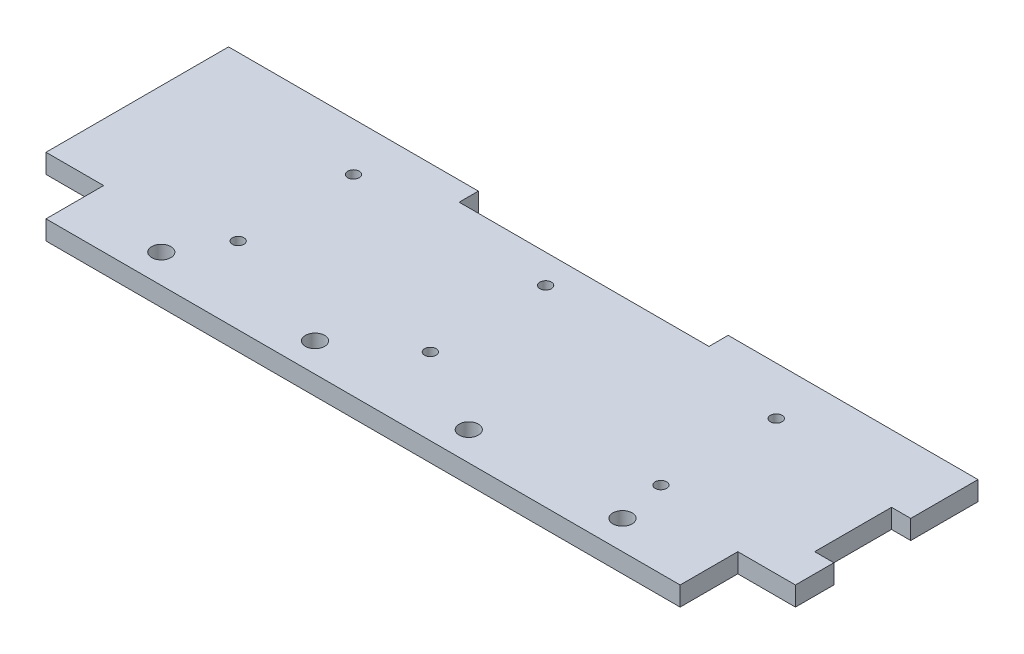
ISO-10303-21;
HEADER;
FILE_DESCRIPTION(('STEP AP214'),'2;1');
FILE_NAME('part.step','',(''),(''),'','','');
FILE_SCHEMA(('AUTOMOTIVE_DESIGN { 1 0 10303 214 1 1 1 1 }'));
ENDSEC;
DATA;
#1=APPLICATION_CONTEXT('core data for automotive mechanical design processes');
#2=APPLICATION_PROTOCOL_DEFINITION('international standard','automotive_design',2000,#1);
#3=PRODUCT_CONTEXT('',#1,'mechanical');
#4=PRODUCT('Part','Part','',(#3));
#5=PRODUCT_RELATED_PRODUCT_CATEGORY('part','',(#4));
#6=PRODUCT_DEFINITION_FORMATION('','',#4);
#7=PRODUCT_DEFINITION_CONTEXT('part definition',#1,'design');
#8=PRODUCT_DEFINITION('design','',#6,#7);
#9=PRODUCT_DEFINITION_SHAPE('','',#8);
#10=(LENGTH_UNIT() NAMED_UNIT(*) SI_UNIT(.MILLI.,.METRE.));
#11=(NAMED_UNIT(*) PLANE_ANGLE_UNIT() SI_UNIT($,.RADIAN.));
#12=(NAMED_UNIT(*) SI_UNIT($,.STERADIAN.) SOLID_ANGLE_UNIT());
#13=UNCERTAINTY_MEASURE_WITH_UNIT(LENGTH_MEASURE(1.E-05),#10,'distance_accuracy_value','');
#14=(GEOMETRIC_REPRESENTATION_CONTEXT(3) GLOBAL_UNCERTAINTY_ASSIGNED_CONTEXT((#13)) GLOBAL_UNIT_ASSIGNED_CONTEXT((#10,
#11,#12)) REPRESENTATION_CONTEXT('',''));
#15=CARTESIAN_POINT('',(0.,0.,0.));
#16=DIRECTION('',(0.,0.,1.));
#17=DIRECTION('',(1.,0.,0.));
#18=AXIS2_PLACEMENT_3D('',#15,#16,#17);
#19=CARTESIAN_POINT('',(0.,10.,0.));
#20=DIRECTION('',(0.,-1.,0.));
#21=DIRECTION('',(0.,0.,-1.));
#22=AXIS2_PLACEMENT_3D('',#19,#20,#21);
#23=PLANE('',#22);
#24=DIRECTION('',(0.,0.,-1.));
#25=VECTOR('',#24,1.);
#26=CARTESIAN_POINT('',(-30.,10.,-15.));
#27=LINE('',#26,#25);
#28=CARTESIAN_POINT('',(-30.,10.,-15.));
#29=VERTEX_POINT('',#28);
#30=CARTESIAN_POINT('',(-30.,10.,-45.));
#31=VERTEX_POINT('',#30);
#32=EDGE_CURVE('E51',#29,#31,#27,.T.);
#33=ORIENTED_EDGE('',*,*,#32,.T.);
#34=DIRECTION('',(1.,0.,0.));
#35=VECTOR('',#34,1.);
#36=CARTESIAN_POINT('',(0.,10.,-45.));
#37=LINE('',#36,#35);
#38=CARTESIAN_POINT('',(0.,10.,-45.));
#39=VERTEX_POINT('',#38);
#40=EDGE_CURVE('E158',#31,#39,#37,.T.);
#41=ORIENTED_EDGE('',*,*,#40,.T.);
#42=DIRECTION('',(0.,0.,-1.));
#43=VECTOR('',#42,1.);
#44=CARTESIAN_POINT('',(0.,10.,-65.));
#45=LINE('',#44,#43);
#46=CARTESIAN_POINT('',(0.,10.,-65.));
#47=VERTEX_POINT('',#46);
#48=EDGE_CURVE('E252',#39,#47,#45,.T.);
#49=ORIENTED_EDGE('',*,*,#48,.T.);
#50=DIRECTION('',(-1.,0.,0.));
#51=VECTOR('',#50,1.);
#52=CARTESIAN_POINT('',(-10.,10.,-65.));
#53=LINE('',#52,#51);
#54=CARTESIAN_POINT('',(-10.,10.,-65.));
#55=VERTEX_POINT('',#54);
#56=EDGE_CURVE('E254',#47,#55,#53,.T.);
#57=ORIENTED_EDGE('',*,*,#56,.T.);
#58=DIRECTION('',(0.,0.,-1.));
#59=VECTOR('',#58,1.);
#60=CARTESIAN_POINT('',(-10.,10.,-105.));
#61=LINE('',#60,#59);
#62=CARTESIAN_POINT('',(-10.,10.,-105.));
#63=VERTEX_POINT('',#62);
#64=EDGE_CURVE('E257',#55,#63,#61,.T.);
#65=ORIENTED_EDGE('',*,*,#64,.T.);
#66=DIRECTION('',(1.,0.,0.));
#67=VECTOR('',#66,1.);
#68=CARTESIAN_POINT('',(0.,10.,-105.));
#69=LINE('',#68,#67);
#70=CARTESIAN_POINT('',(0.,10.,-105.));
#71=VERTEX_POINT('',#70);
#72=EDGE_CURVE('E259',#63,#71,#69,.T.);
#73=ORIENTED_EDGE('',*,*,#72,.T.);
#74=DIRECTION('',(0.,0.,-1.));
#75=VECTOR('',#74,1.);
#76=CARTESIAN_POINT('',(0.,10.,-140.));
#77=LINE('',#76,#75);
#78=CARTESIAN_POINT('',(0.,10.,-140.));
#79=VERTEX_POINT('',#78);
#80=EDGE_CURVE('E261',#71,#79,#77,.T.);
#81=ORIENTED_EDGE('',*,*,#80,.T.);
#82=DIRECTION('',(-1.,0.,0.));
#83=VECTOR('',#82,1.);
#84=CARTESIAN_POINT('',(0.,10.,-140.));
#85=LINE('',#84,#83);
#86=CARTESIAN_POINT('',(-130.,10.,-140.));
#87=VERTEX_POINT('',#86);
#88=EDGE_CURVE('E263',#79,#87,#85,.T.);
#89=ORIENTED_EDGE('',*,*,#88,.T.);
#90=DIRECTION('',(0.,0.,1.));
#91=VECTOR('',#90,1.);
#92=CARTESIAN_POINT('',(-130.,10.,-140.));
#93=LINE('',#92,#91);
#94=CARTESIAN_POINT('',(-130.,10.,-130.));
#95=VERTEX_POINT('',#94);
#96=EDGE_CURVE('E265',#87,#95,#93,.T.);
#97=ORIENTED_EDGE('',*,*,#96,.T.);
#98=DIRECTION('',(-1.,0.,0.));
#99=VECTOR('',#98,1.);
#100=CARTESIAN_POINT('',(-130.,10.,-130.));
#101=LINE('',#100,#99);
#102=CARTESIAN_POINT('',(-260.,10.,-130.));
#103=VERTEX_POINT('',#102);
#104=EDGE_CURVE('E267',#95,#103,#101,.T.);
#105=ORIENTED_EDGE('',*,*,#104,.T.);
#106=DIRECTION('',(0.,0.,-1.));
#107=VECTOR('',#106,1.);
#108=CARTESIAN_POINT('',(-260.,10.,-130.));
#109=LINE('',#108,#107);
#110=CARTESIAN_POINT('',(-260.,10.,-140.));
#111=VERTEX_POINT('',#110);
#112=EDGE_CURVE('E269',#103,#111,#109,.T.);
#113=ORIENTED_EDGE('',*,*,#112,.T.);
#114=DIRECTION('',(-1.,0.,0.));
#115=VECTOR('',#114,1.);
#116=CARTESIAN_POINT('',(-260.,10.,-140.));
#117=LINE('',#116,#115);
#118=CARTESIAN_POINT('',(-390.,10.,-140.));
#119=VERTEX_POINT('',#118);
#120=EDGE_CURVE('E271',#111,#119,#117,.T.);
#121=ORIENTED_EDGE('',*,*,#120,.T.);
#122=DIRECTION('',(0.,0.,1.));
#123=VECTOR('',#122,1.);
#124=CARTESIAN_POINT('',(-390.,10.,-15.));
#125=LINE('',#124,#123);
#126=CARTESIAN_POINT('',(-390.,10.,-45.));
#127=VERTEX_POINT('',#126);
#128=EDGE_CURVE('E273',#119,#127,#125,.T.);
#129=ORIENTED_EDGE('',*,*,#128,.T.);
#130=DIRECTION('',(1.,0.,0.));
#131=VECTOR('',#130,1.);
#132=CARTESIAN_POINT('',(-390.,10.,-45.));
#133=LINE('',#132,#131);
#134=CARTESIAN_POINT('',(-360.,10.,-45.));
#135=VERTEX_POINT('',#134);
#136=EDGE_CURVE('E178',#127,#135,#133,.T.);
#137=ORIENTED_EDGE('',*,*,#136,.T.);
#138=DIRECTION('',(0.,0.,1.));
#139=VECTOR('',#138,1.);
#140=CARTESIAN_POINT('',(-360.,10.,-15.));
#141=LINE('',#140,#139);
#142=CARTESIAN_POINT('',(-360.,10.,-15.));
#143=VERTEX_POINT('',#142);
#144=EDGE_CURVE('E181',#135,#143,#141,.T.);
#145=ORIENTED_EDGE('',*,*,#144,.T.);
#146=DIRECTION('',(1.,0.,0.));
#147=VECTOR('',#146,1.);
#148=CARTESIAN_POINT('',(0.,10.,-15.));
#149=LINE('',#148,#147);
#150=EDGE_CURVE('E168',#143,#29,#149,.T.);
#151=ORIENTED_EDGE('',*,*,#150,.T.);
#152=EDGE_LOOP('',(#33,#41,#49,#57,#65,#73,#81,#89,#97,#105,#113,#121,#129,#137,#145,#151));
#153=FACE_BOUND('',#152,.T.);
#154=CARTESIAN_POINT('',(-315.,10.,-30.));
#155=DIRECTION('',(0.,1.,0.));
#156=DIRECTION('',(0.,0.,1.));
#157=AXIS2_PLACEMENT_3D('',#154,#155,#156);
#158=CIRCLE('',#157,4.99999999999999);
#159=CARTESIAN_POINT('',(-315.,10.,-25.));
#160=VERTEX_POINT('',#159);
#161=EDGE_CURVE('E246',#160,#160,#158,.T.);
#162=ORIENTED_EDGE('',*,*,#161,.F.);
#163=EDGE_LOOP('',(#162));
#164=FACE_BOUND('',#163,.T.);
#165=CARTESIAN_POINT('',(-155.,10.,-30.));
#166=DIRECTION('',(0.,1.,0.));
#167=DIRECTION('',(0.,0.,1.));
#168=AXIS2_PLACEMENT_3D('',#165,#166,#167);
#169=CIRCLE('',#168,5.00000000000002);
#170=CARTESIAN_POINT('',(-155.,10.,-25.));
#171=VERTEX_POINT('',#170);
#172=EDGE_CURVE('E240',#171,#171,#169,.T.);
#173=ORIENTED_EDGE('',*,*,#172,.F.);
#174=EDGE_LOOP('',(#173));
#175=FACE_BOUND('',#174,.T.);
#176=CARTESIAN_POINT('',(-75.,10.,-30.));
#177=DIRECTION('',(0.,1.,0.));
#178=DIRECTION('',(0.,0.,1.));
#179=AXIS2_PLACEMENT_3D('',#176,#177,#178);
#180=CIRCLE('',#179,5.00000000000001);
#181=CARTESIAN_POINT('',(-75.,10.,-25.));
#182=VERTEX_POINT('',#181);
#183=EDGE_CURVE('E234',#182,#182,#180,.T.);
#184=ORIENTED_EDGE('',*,*,#183,.F.);
#185=EDGE_LOOP('',(#184));
#186=FACE_BOUND('',#185,.T.);
#187=CARTESIAN_POINT('',(-200.,10.,-55.));
#188=DIRECTION('',(0.,1.,0.));
#189=DIRECTION('',(0.,0.,1.));
#190=AXIS2_PLACEMENT_3D('',#187,#188,#189);
#191=CIRCLE('',#190,2.99999999999999);
#192=CARTESIAN_POINT('',(-200.,10.,-52.));
#193=VERTEX_POINT('',#192);
#194=EDGE_CURVE('E228',#193,#193,#191,.T.);
#195=ORIENTED_EDGE('',*,*,#194,.F.);
#196=EDGE_LOOP('',(#195));
#197=FACE_BOUND('',#196,.T.);
#198=CARTESIAN_POINT('',(-300.,10.,-55.));
#199=DIRECTION('',(0.,1.,0.));
#200=DIRECTION('',(0.,0.,1.));
#201=AXIS2_PLACEMENT_3D('',#198,#199,#200);
#202=CIRCLE('',#201,2.99999999999999);
#203=CARTESIAN_POINT('',(-300.,10.,-52.));
#204=VERTEX_POINT('',#203);
#205=EDGE_CURVE('E222',#204,#204,#202,.T.);
#206=ORIENTED_EDGE('',*,*,#205,.F.);
#207=EDGE_LOOP('',(#206));
#208=FACE_BOUND('',#207,.T.);
#209=CARTESIAN_POINT('',(-300.,10.,-115.));
#210=DIRECTION('',(0.,1.,0.));
#211=DIRECTION('',(0.,0.,1.));
#212=AXIS2_PLACEMENT_3D('',#209,#210,#211);
#213=CIRCLE('',#212,2.99999999999999);
#214=CARTESIAN_POINT('',(-300.,10.,-112.));
#215=VERTEX_POINT('',#214);
#216=EDGE_CURVE('E216',#215,#215,#213,.T.);
#217=ORIENTED_EDGE('',*,*,#216,.F.);
#218=EDGE_LOOP('',(#217));
#219=FACE_BOUND('',#218,.T.);
#220=CARTESIAN_POINT('',(-235.,10.,-30.));
#221=DIRECTION('',(0.,1.,0.));
#222=DIRECTION('',(0.,0.,1.));
#223=AXIS2_PLACEMENT_3D('',#220,#221,#222);
#224=CIRCLE('',#223,5.00000000000002);
#225=CARTESIAN_POINT('',(-235.,10.,-25.));
#226=VERTEX_POINT('',#225);
#227=EDGE_CURVE('E210',#226,#226,#224,.T.);
#228=ORIENTED_EDGE('',*,*,#227,.F.);
#229=EDGE_LOOP('',(#228));
#230=FACE_BOUND('',#229,.T.);
#231=CARTESIAN_POINT('',(-200.,10.,-115.));
#232=DIRECTION('',(0.,1.,0.));
#233=DIRECTION('',(0.,0.,1.));
#234=AXIS2_PLACEMENT_3D('',#231,#232,#233);
#235=CIRCLE('',#234,2.99999999999999);
#236=CARTESIAN_POINT('',(-200.,10.,-112.));
#237=VERTEX_POINT('',#236);
#238=EDGE_CURVE('E204',#237,#237,#235,.T.);
#239=ORIENTED_EDGE('',*,*,#238,.F.);
#240=EDGE_LOOP('',(#239));
#241=FACE_BOUND('',#240,.T.);
#242=CARTESIAN_POINT('',(-80.,10.,-115.));
#243=DIRECTION('',(0.,1.,0.));
#244=DIRECTION('',(0.,0.,1.));
#245=AXIS2_PLACEMENT_3D('',#242,#243,#244);
#246=CIRCLE('',#245,3.00000000000001);
#247=CARTESIAN_POINT('',(-80.,10.,-112.));
#248=VERTEX_POINT('',#247);
#249=EDGE_CURVE('E198',#248,#248,#246,.T.);
#250=ORIENTED_EDGE('',*,*,#249,.F.);
#251=EDGE_LOOP('',(#250));
#252=FACE_BOUND('',#251,.T.);
#253=CARTESIAN_POINT('',(-80.,10.,-55.));
#254=DIRECTION('',(0.,1.,0.));
#255=DIRECTION('',(0.,0.,1.));
#256=AXIS2_PLACEMENT_3D('',#253,#254,#255);
#257=CIRCLE('',#256,3.00000000000001);
#258=CARTESIAN_POINT('',(-80.,10.,-52.));
#259=VERTEX_POINT('',#258);
#260=EDGE_CURVE('E192',#259,#259,#257,.T.);
#261=ORIENTED_EDGE('',*,*,#260,.F.);
#262=EDGE_LOOP('',(#261));
#263=FACE_BOUND('',#262,.T.);
#264=ADVANCED_FACE('F36',(#153,#164,#175,#186,#197,#208,#219,#230,#241,#252,#263),#23,.F.);
#265=CARTESIAN_POINT('',(0.,0.,0.));
#266=DIRECTION('',(0.,-1.,0.));
#267=DIRECTION('',(0.,0.,-1.));
#268=AXIS2_PLACEMENT_3D('',#265,#266,#267);
#269=PLANE('',#268);
#270=DIRECTION('',(1.,0.,0.));
#271=VECTOR('',#270,1.);
#272=CARTESIAN_POINT('',(0.,0.,-45.));
#273=LINE('',#272,#271);
#274=CARTESIAN_POINT('',(-30.,0.,-45.));
#275=VERTEX_POINT('',#274);
#276=CARTESIAN_POINT('',(0.,0.,-45.));
#277=VERTEX_POINT('',#276);
#278=EDGE_CURVE('E169',#275,#277,#273,.T.);
#279=ORIENTED_EDGE('',*,*,#278,.F.);
#280=DIRECTION('',(0.,0.,-1.));
#281=VECTOR('',#280,1.);
#282=CARTESIAN_POINT('',(-30.,0.,-15.));
#283=LINE('',#282,#281);
#284=CARTESIAN_POINT('',(-30.,0.,-15.));
#285=VERTEX_POINT('',#284);
#286=EDGE_CURVE('E151',#285,#275,#283,.T.);
#287=ORIENTED_EDGE('',*,*,#286,.F.);
#288=DIRECTION('',(1.,0.,0.));
#289=VECTOR('',#288,1.);
#290=CARTESIAN_POINT('',(0.,0.,-15.));
#291=LINE('',#290,#289);
#292=CARTESIAN_POINT('',(-360.,0.,-15.));
#293=VERTEX_POINT('',#292);
#294=EDGE_CURVE('E255',#293,#285,#291,.T.);
#295=ORIENTED_EDGE('',*,*,#294,.F.);
#296=DIRECTION('',(0.,0.,1.));
#297=VECTOR('',#296,1.);
#298=CARTESIAN_POINT('',(-360.,0.,-15.));
#299=LINE('',#298,#297);
#300=CARTESIAN_POINT('',(-360.,0.,-45.));
#301=VERTEX_POINT('',#300);
#302=EDGE_CURVE('E59',#301,#293,#299,.T.);
#303=ORIENTED_EDGE('',*,*,#302,.F.);
#304=DIRECTION('',(1.,0.,0.));
#305=VECTOR('',#304,1.);
#306=CARTESIAN_POINT('',(-390.,0.,-45.));
#307=LINE('',#306,#305);
#308=CARTESIAN_POINT('',(-390.,0.,-45.));
#309=VERTEX_POINT('',#308);
#310=EDGE_CURVE('E184',#309,#301,#307,.T.);
#311=ORIENTED_EDGE('',*,*,#310,.F.);
#312=DIRECTION('',(0.,0.,1.));
#313=VECTOR('',#312,1.);
#314=CARTESIAN_POINT('',(-390.,0.,-15.));
#315=LINE('',#314,#313);
#316=CARTESIAN_POINT('',(-390.,0.,-140.));
#317=VERTEX_POINT('',#316);
#318=EDGE_CURVE('E297',#317,#309,#315,.T.);
#319=ORIENTED_EDGE('',*,*,#318,.F.);
#320=DIRECTION('',(-1.,0.,0.));
#321=VECTOR('',#320,1.);
#322=CARTESIAN_POINT('',(-260.,0.,-140.));
#323=LINE('',#322,#321);
#324=CARTESIAN_POINT('',(-260.,0.,-140.));
#325=VERTEX_POINT('',#324);
#326=EDGE_CURVE('E295',#325,#317,#323,.T.);
#327=ORIENTED_EDGE('',*,*,#326,.F.);
#328=DIRECTION('',(0.,0.,-1.));
#329=VECTOR('',#328,1.);
#330=CARTESIAN_POINT('',(-260.,0.,-130.));
#331=LINE('',#330,#329);
#332=CARTESIAN_POINT('',(-260.,0.,-130.));
#333=VERTEX_POINT('',#332);
#334=EDGE_CURVE('E293',#333,#325,#331,.T.);
#335=ORIENTED_EDGE('',*,*,#334,.F.);
#336=DIRECTION('',(-1.,0.,0.));
#337=VECTOR('',#336,1.);
#338=CARTESIAN_POINT('',(-130.,0.,-130.));
#339=LINE('',#338,#337);
#340=CARTESIAN_POINT('',(-130.,0.,-130.));
#341=VERTEX_POINT('',#340);
#342=EDGE_CURVE('E291',#341,#333,#339,.T.);
#343=ORIENTED_EDGE('',*,*,#342,.F.);
#344=DIRECTION('',(0.,0.,1.));
#345=VECTOR('',#344,1.);
#346=CARTESIAN_POINT('',(-130.,0.,-140.));
#347=LINE('',#346,#345);
#348=CARTESIAN_POINT('',(-130.,0.,-140.));
#349=VERTEX_POINT('',#348);
#350=EDGE_CURVE('E289',#349,#341,#347,.T.);
#351=ORIENTED_EDGE('',*,*,#350,.F.);
#352=DIRECTION('',(-1.,0.,0.));
#353=VECTOR('',#352,1.);
#354=CARTESIAN_POINT('',(0.,0.,-140.));
#355=LINE('',#354,#353);
#356=CARTESIAN_POINT('',(0.,0.,-140.));
#357=VERTEX_POINT('',#356);
#358=EDGE_CURVE('E287',#357,#349,#355,.T.);
#359=ORIENTED_EDGE('',*,*,#358,.F.);
#360=DIRECTION('',(0.,0.,-1.));
#361=VECTOR('',#360,1.);
#362=CARTESIAN_POINT('',(0.,0.,-140.));
#363=LINE('',#362,#361);
#364=CARTESIAN_POINT('',(0.,0.,-105.));
#365=VERTEX_POINT('',#364);
#366=EDGE_CURVE('E285',#365,#357,#363,.T.);
#367=ORIENTED_EDGE('',*,*,#366,.F.);
#368=DIRECTION('',(1.,0.,0.));
#369=VECTOR('',#368,1.);
#370=CARTESIAN_POINT('',(0.,0.,-105.));
#371=LINE('',#370,#369);
#372=CARTESIAN_POINT('',(-10.,0.,-105.));
#373=VERTEX_POINT('',#372);
#374=EDGE_CURVE('E283',#373,#365,#371,.T.);
#375=ORIENTED_EDGE('',*,*,#374,.F.);
#376=DIRECTION('',(0.,0.,-1.));
#377=VECTOR('',#376,1.);
#378=CARTESIAN_POINT('',(-10.,0.,-105.));
#379=LINE('',#378,#377);
#380=CARTESIAN_POINT('',(-10.,0.,-65.));
#381=VERTEX_POINT('',#380);
#382=EDGE_CURVE('E281',#381,#373,#379,.T.);
#383=ORIENTED_EDGE('',*,*,#382,.F.);
#384=DIRECTION('',(-1.,0.,0.));
#385=VECTOR('',#384,1.);
#386=CARTESIAN_POINT('',(-10.,0.,-65.));
#387=LINE('',#386,#385);
#388=CARTESIAN_POINT('',(0.,0.,-65.));
#389=VERTEX_POINT('',#388);
#390=EDGE_CURVE('E279',#389,#381,#387,.T.);
#391=ORIENTED_EDGE('',*,*,#390,.F.);
#392=DIRECTION('',(0.,0.,-1.));
#393=VECTOR('',#392,1.);
#394=CARTESIAN_POINT('',(0.,0.,-65.));
#395=LINE('',#394,#393);
#396=EDGE_CURVE('E249',#277,#389,#395,.T.);
#397=ORIENTED_EDGE('',*,*,#396,.F.);
#398=EDGE_LOOP('',(#279,#287,#295,#303,#311,#319,#327,#335,#343,#351,#359,#367,#375,#383,#391,#397));
#399=FACE_BOUND('',#398,.T.);
#400=CARTESIAN_POINT('',(-80.,0.,-115.));
#401=DIRECTION('',(0.,1.,0.));
#402=DIRECTION('',(0.,0.,1.));
#403=AXIS2_PLACEMENT_3D('',#400,#401,#402);
#404=CIRCLE('',#403,3.00000000000001);
#405=CARTESIAN_POINT('',(-80.,0.,-112.));
#406=VERTEX_POINT('',#405);
#407=EDGE_CURVE('E195',#406,#406,#404,.T.);
#408=ORIENTED_EDGE('',*,*,#407,.T.);
#409=EDGE_LOOP('',(#408));
#410=FACE_BOUND('',#409,.T.);
#411=CARTESIAN_POINT('',(-235.,0.,-30.));
#412=DIRECTION('',(0.,1.,0.));
#413=DIRECTION('',(0.,0.,1.));
#414=AXIS2_PLACEMENT_3D('',#411,#412,#413);
#415=CIRCLE('',#414,5.00000000000002);
#416=CARTESIAN_POINT('',(-235.,0.,-25.));
#417=VERTEX_POINT('',#416);
#418=EDGE_CURVE('E207',#417,#417,#415,.T.);
#419=ORIENTED_EDGE('',*,*,#418,.T.);
#420=EDGE_LOOP('',(#419));
#421=FACE_BOUND('',#420,.T.);
#422=CARTESIAN_POINT('',(-300.,0.,-55.));
#423=DIRECTION('',(0.,1.,0.));
#424=DIRECTION('',(0.,0.,1.));
#425=AXIS2_PLACEMENT_3D('',#422,#423,#424);
#426=CIRCLE('',#425,2.99999999999999);
#427=CARTESIAN_POINT('',(-300.,0.,-52.));
#428=VERTEX_POINT('',#427);
#429=EDGE_CURVE('E219',#428,#428,#426,.T.);
#430=ORIENTED_EDGE('',*,*,#429,.T.);
#431=EDGE_LOOP('',(#430));
#432=FACE_BOUND('',#431,.T.);
#433=CARTESIAN_POINT('',(-75.,0.,-30.));
#434=DIRECTION('',(0.,1.,0.));
#435=DIRECTION('',(0.,0.,1.));
#436=AXIS2_PLACEMENT_3D('',#433,#434,#435);
#437=CIRCLE('',#436,5.00000000000001);
#438=CARTESIAN_POINT('',(-75.,0.,-25.));
#439=VERTEX_POINT('',#438);
#440=EDGE_CURVE('E231',#439,#439,#437,.T.);
#441=ORIENTED_EDGE('',*,*,#440,.T.);
#442=EDGE_LOOP('',(#441));
#443=FACE_BOUND('',#442,.T.);
#444=CARTESIAN_POINT('',(-315.,0.,-30.));
#445=DIRECTION('',(0.,1.,0.));
#446=DIRECTION('',(0.,0.,1.));
#447=AXIS2_PLACEMENT_3D('',#444,#445,#446);
#448=CIRCLE('',#447,4.99999999999999);
#449=CARTESIAN_POINT('',(-315.,0.,-25.));
#450=VERTEX_POINT('',#449);
#451=EDGE_CURVE('E243',#450,#450,#448,.T.);
#452=ORIENTED_EDGE('',*,*,#451,.T.);
#453=EDGE_LOOP('',(#452));
#454=FACE_BOUND('',#453,.T.);
#455=CARTESIAN_POINT('',(-155.,0.,-30.));
#456=DIRECTION('',(0.,1.,0.));
#457=DIRECTION('',(0.,0.,1.));
#458=AXIS2_PLACEMENT_3D('',#455,#456,#457);
#459=CIRCLE('',#458,5.00000000000002);
#460=CARTESIAN_POINT('',(-155.,0.,-25.));
#461=VERTEX_POINT('',#460);
#462=EDGE_CURVE('E237',#461,#461,#459,.T.);
#463=ORIENTED_EDGE('',*,*,#462,.T.);
#464=EDGE_LOOP('',(#463));
#465=FACE_BOUND('',#464,.T.);
#466=CARTESIAN_POINT('',(-200.,0.,-55.));
#467=DIRECTION('',(0.,1.,0.));
#468=DIRECTION('',(0.,0.,1.));
#469=AXIS2_PLACEMENT_3D('',#466,#467,#468);
#470=CIRCLE('',#469,2.99999999999999);
#471=CARTESIAN_POINT('',(-200.,0.,-52.));
#472=VERTEX_POINT('',#471);
#473=EDGE_CURVE('E225',#472,#472,#470,.T.);
#474=ORIENTED_EDGE('',*,*,#473,.T.);
#475=EDGE_LOOP('',(#474));
#476=FACE_BOUND('',#475,.T.);
#477=CARTESIAN_POINT('',(-300.,0.,-115.));
#478=DIRECTION('',(0.,1.,0.));
#479=DIRECTION('',(0.,0.,1.));
#480=AXIS2_PLACEMENT_3D('',#477,#478,#479);
#481=CIRCLE('',#480,2.99999999999999);
#482=CARTESIAN_POINT('',(-300.,0.,-112.));
#483=VERTEX_POINT('',#482);
#484=EDGE_CURVE('E213',#483,#483,#481,.T.);
#485=ORIENTED_EDGE('',*,*,#484,.T.);
#486=EDGE_LOOP('',(#485));
#487=FACE_BOUND('',#486,.T.);
#488=CARTESIAN_POINT('',(-200.,0.,-115.));
#489=DIRECTION('',(0.,1.,0.));
#490=DIRECTION('',(0.,0.,1.));
#491=AXIS2_PLACEMENT_3D('',#488,#489,#490);
#492=CIRCLE('',#491,2.99999999999999);
#493=CARTESIAN_POINT('',(-200.,0.,-112.));
#494=VERTEX_POINT('',#493);
#495=EDGE_CURVE('E201',#494,#494,#492,.T.);
#496=ORIENTED_EDGE('',*,*,#495,.T.);
#497=EDGE_LOOP('',(#496));
#498=FACE_BOUND('',#497,.T.);
#499=CARTESIAN_POINT('',(-80.,0.,-55.));
#500=DIRECTION('',(0.,1.,0.));
#501=DIRECTION('',(0.,0.,1.));
#502=AXIS2_PLACEMENT_3D('',#499,#500,#501);
#503=CIRCLE('',#502,3.00000000000001);
#504=CARTESIAN_POINT('',(-80.,0.,-52.));
#505=VERTEX_POINT('',#504);
#506=EDGE_CURVE('E175',#505,#505,#503,.T.);
#507=ORIENTED_EDGE('',*,*,#506,.T.);
#508=EDGE_LOOP('',(#507));
#509=FACE_BOUND('',#508,.T.);
#510=ADVANCED_FACE('F336',(#399,#410,#421,#432,#443,#454,#465,#476,#487,#498,#509),#269,.T.);
#511=CARTESIAN_POINT('',(0.,10.,-65.));
#512=DIRECTION('',(-1.,0.,0.));
#513=DIRECTION('',(0.,0.,1.));
#514=AXIS2_PLACEMENT_3D('',#511,#512,#513);
#515=PLANE('',#514);
#516=ORIENTED_EDGE('',*,*,#48,.F.);
#517=DIRECTION('',(0.,-1.,0.));
#518=VECTOR('',#517,1.);
#519=CARTESIAN_POINT('',(0.,10.,-45.));
#520=LINE('',#519,#518);
#521=EDGE_CURVE('E154',#39,#277,#520,.T.);
#522=ORIENTED_EDGE('',*,*,#521,.T.);
#523=ORIENTED_EDGE('',*,*,#396,.T.);
#524=DIRECTION('',(0.,-1.,0.));
#525=VECTOR('',#524,1.);
#526=CARTESIAN_POINT('',(0.,10.,-65.));
#527=LINE('',#526,#525);
#528=EDGE_CURVE('E11',#47,#389,#527,.T.);
#529=ORIENTED_EDGE('',*,*,#528,.F.);
#530=EDGE_LOOP('',(#516,#522,#523,#529));
#531=FACE_BOUND('',#530,.T.);
#532=ADVANCED_FACE('F38',(#531),#515,.F.);
#533=CARTESIAN_POINT('',(-10.,10.,-65.));
#534=DIRECTION('',(0.,0.,1.));
#535=DIRECTION('',(1.,0.,0.));
#536=AXIS2_PLACEMENT_3D('',#533,#534,#535);
#537=PLANE('',#536);
#538=ORIENTED_EDGE('',*,*,#390,.T.);
#539=DIRECTION('',(0.,-1.,0.));
#540=VECTOR('',#539,1.);
#541=CARTESIAN_POINT('',(-10.,10.,-65.));
#542=LINE('',#541,#540);
#543=EDGE_CURVE('E44',#55,#381,#542,.T.);
#544=ORIENTED_EDGE('',*,*,#543,.F.);
#545=ORIENTED_EDGE('',*,*,#56,.F.);
#546=ORIENTED_EDGE('',*,*,#528,.T.);
#547=EDGE_LOOP('',(#538,#544,#545,#546));
#548=FACE_BOUND('',#547,.T.);
#549=ADVANCED_FACE('F352',(#548),#537,.F.);
#550=CARTESIAN_POINT('',(-10.,10.,-105.));
#551=DIRECTION('',(-1.,0.,0.));
#552=DIRECTION('',(0.,0.,1.));
#553=AXIS2_PLACEMENT_3D('',#550,#551,#552);
#554=PLANE('',#553);
#555=ORIENTED_EDGE('',*,*,#382,.T.);
#556=DIRECTION('',(0.,-1.,0.));
#557=VECTOR('',#556,1.);
#558=CARTESIAN_POINT('',(-10.,10.,-105.));
#559=LINE('',#558,#557);
#560=EDGE_CURVE('E322',#63,#373,#559,.T.);
#561=ORIENTED_EDGE('',*,*,#560,.F.);
#562=ORIENTED_EDGE('',*,*,#64,.F.);
#563=ORIENTED_EDGE('',*,*,#543,.T.);
#564=EDGE_LOOP('',(#555,#561,#562,#563));
#565=FACE_BOUND('',#564,.T.);
#566=ADVANCED_FACE('F329',(#565),#554,.F.);
#567=CARTESIAN_POINT('',(0.,10.,-105.));
#568=DIRECTION('',(0.,0.,-1.));
#569=DIRECTION('',(-1.,0.,0.));
#570=AXIS2_PLACEMENT_3D('',#567,#568,#569);
#571=PLANE('',#570);
#572=ORIENTED_EDGE('',*,*,#374,.T.);
#573=DIRECTION('',(0.,-1.,0.));
#574=VECTOR('',#573,1.);
#575=CARTESIAN_POINT('',(0.,10.,-105.));
#576=LINE('',#575,#574);
#577=EDGE_CURVE('E319',#71,#365,#576,.T.);
#578=ORIENTED_EDGE('',*,*,#577,.F.);
#579=ORIENTED_EDGE('',*,*,#72,.F.);
#580=ORIENTED_EDGE('',*,*,#560,.T.);
#581=EDGE_LOOP('',(#572,#578,#579,#580));
#582=FACE_BOUND('',#581,.T.);
#583=ADVANCED_FACE('F343',(#582),#571,.F.);
#584=CARTESIAN_POINT('',(0.,10.,-140.));
#585=DIRECTION('',(-1.,0.,0.));
#586=DIRECTION('',(0.,0.,1.));
#587=AXIS2_PLACEMENT_3D('',#584,#585,#586);
#588=PLANE('',#587);
#589=ORIENTED_EDGE('',*,*,#366,.T.);
#590=DIRECTION('',(0.,-1.,0.));
#591=VECTOR('',#590,1.);
#592=CARTESIAN_POINT('',(0.,10.,-140.));
#593=LINE('',#592,#591);
#594=EDGE_CURVE('E316',#79,#357,#593,.T.);
#595=ORIENTED_EDGE('',*,*,#594,.F.);
#596=ORIENTED_EDGE('',*,*,#80,.F.);
#597=ORIENTED_EDGE('',*,*,#577,.T.);
#598=EDGE_LOOP('',(#589,#595,#596,#597));
#599=FACE_BOUND('',#598,.T.);
#600=ADVANCED_FACE('F347',(#599),#588,.F.);
#601=CARTESIAN_POINT('',(0.,10.,-140.));
#602=DIRECTION('',(0.,0.,1.));
#603=DIRECTION('',(1.,0.,0.));
#604=AXIS2_PLACEMENT_3D('',#601,#602,#603);
#605=PLANE('',#604);
#606=ORIENTED_EDGE('',*,*,#358,.T.);
#607=DIRECTION('',(0.,-1.,0.));
#608=VECTOR('',#607,1.);
#609=CARTESIAN_POINT('',(-130.,10.,-140.));
#610=LINE('',#609,#608);
#611=EDGE_CURVE('E313',#87,#349,#610,.T.);
#612=ORIENTED_EDGE('',*,*,#611,.F.);
#613=ORIENTED_EDGE('',*,*,#88,.F.);
#614=ORIENTED_EDGE('',*,*,#594,.T.);
#615=EDGE_LOOP('',(#606,#612,#613,#614));
#616=FACE_BOUND('',#615,.T.);
#617=ADVANCED_FACE('F388',(#616),#605,.F.);
#618=CARTESIAN_POINT('',(-130.,10.,-140.));
#619=DIRECTION('',(1.,0.,0.));
#620=DIRECTION('',(0.,0.,-1.));
#621=AXIS2_PLACEMENT_3D('',#618,#619,#620);
#622=PLANE('',#621);
#623=ORIENTED_EDGE('',*,*,#350,.T.);
#624=DIRECTION('',(0.,-1.,0.));
#625=VECTOR('',#624,1.);
#626=CARTESIAN_POINT('',(-130.,10.,-130.));
#627=LINE('',#626,#625);
#628=EDGE_CURVE('E310',#95,#341,#627,.T.);
#629=ORIENTED_EDGE('',*,*,#628,.F.);
#630=ORIENTED_EDGE('',*,*,#96,.F.);
#631=ORIENTED_EDGE('',*,*,#611,.T.);
#632=EDGE_LOOP('',(#623,#629,#630,#631));
#633=FACE_BOUND('',#632,.T.);
#634=ADVANCED_FACE('F385',(#633),#622,.F.);
#635=CARTESIAN_POINT('',(-130.,10.,-130.));
#636=DIRECTION('',(0.,0.,1.));
#637=DIRECTION('',(1.,0.,0.));
#638=AXIS2_PLACEMENT_3D('',#635,#636,#637);
#639=PLANE('',#638);
#640=ORIENTED_EDGE('',*,*,#342,.T.);
#641=DIRECTION('',(0.,-1.,0.));
#642=VECTOR('',#641,1.);
#643=CARTESIAN_POINT('',(-260.,10.,-130.));
#644=LINE('',#643,#642);
#645=EDGE_CURVE('E307',#103,#333,#644,.T.);
#646=ORIENTED_EDGE('',*,*,#645,.F.);
#647=ORIENTED_EDGE('',*,*,#104,.F.);
#648=ORIENTED_EDGE('',*,*,#628,.T.);
#649=EDGE_LOOP('',(#640,#646,#647,#648));
#650=FACE_BOUND('',#649,.T.);
#651=ADVANCED_FACE('F381',(#650),#639,.F.);
#652=CARTESIAN_POINT('',(-260.,10.,-130.));
#653=DIRECTION('',(-1.,0.,0.));
#654=DIRECTION('',(0.,0.,1.));
#655=AXIS2_PLACEMENT_3D('',#652,#653,#654);
#656=PLANE('',#655);
#657=ORIENTED_EDGE('',*,*,#334,.T.);
#658=DIRECTION('',(0.,-1.,0.));
#659=VECTOR('',#658,1.);
#660=CARTESIAN_POINT('',(-260.,10.,-140.));
#661=LINE('',#660,#659);
#662=EDGE_CURVE('E304',#111,#325,#661,.T.);
#663=ORIENTED_EDGE('',*,*,#662,.F.);
#664=ORIENTED_EDGE('',*,*,#112,.F.);
#665=ORIENTED_EDGE('',*,*,#645,.T.);
#666=EDGE_LOOP('',(#657,#663,#664,#665));
#667=FACE_BOUND('',#666,.T.);
#668=ADVANCED_FACE('F377',(#667),#656,.F.);
#669=CARTESIAN_POINT('',(-260.,10.,-140.));
#670=DIRECTION('',(0.,0.,1.));
#671=DIRECTION('',(1.,0.,0.));
#672=AXIS2_PLACEMENT_3D('',#669,#670,#671);
#673=PLANE('',#672);
#674=ORIENTED_EDGE('',*,*,#326,.T.);
#675=DIRECTION('',(0.,-1.,0.));
#676=VECTOR('',#675,1.);
#677=CARTESIAN_POINT('',(-390.,10.,-140.));
#678=LINE('',#677,#676);
#679=EDGE_CURVE('E277',#119,#317,#678,.T.);
#680=ORIENTED_EDGE('',*,*,#679,.F.);
#681=ORIENTED_EDGE('',*,*,#120,.F.);
#682=ORIENTED_EDGE('',*,*,#662,.T.);
#683=EDGE_LOOP('',(#674,#680,#681,#682));
#684=FACE_BOUND('',#683,.T.);
#685=ADVANCED_FACE('F372',(#684),#673,.F.);
#686=CARTESIAN_POINT('',(-390.,10.,-15.));
#687=DIRECTION('',(1.,0.,0.));
#688=DIRECTION('',(0.,0.,-1.));
#689=AXIS2_PLACEMENT_3D('',#686,#687,#688);
#690=PLANE('',#689);
#691=ORIENTED_EDGE('',*,*,#318,.T.);
#692=DIRECTION('',(0.,-1.,0.));
#693=VECTOR('',#692,1.);
#694=CARTESIAN_POINT('',(-390.,10.,-45.));
#695=LINE('',#694,#693);
#696=EDGE_CURVE('E183',#127,#309,#695,.T.);
#697=ORIENTED_EDGE('',*,*,#696,.F.);
#698=ORIENTED_EDGE('',*,*,#128,.F.);
#699=ORIENTED_EDGE('',*,*,#679,.T.);
#700=EDGE_LOOP('',(#691,#697,#698,#699));
#701=FACE_BOUND('',#700,.T.);
#702=ADVANCED_FACE('F365',(#701),#690,.F.);
#703=CARTESIAN_POINT('',(0.,10.,-15.));
#704=DIRECTION('',(0.,0.,-1.));
#705=DIRECTION('',(-1.,0.,0.));
#706=AXIS2_PLACEMENT_3D('',#703,#704,#705);
#707=PLANE('',#706);
#708=ORIENTED_EDGE('',*,*,#294,.T.);
#709=DIRECTION('',(0.,-1.,0.));
#710=VECTOR('',#709,1.);
#711=CARTESIAN_POINT('',(-30.,10.,-15.));
#712=LINE('',#711,#710);
#713=EDGE_CURVE('E155',#29,#285,#712,.T.);
#714=ORIENTED_EDGE('',*,*,#713,.F.);
#715=ORIENTED_EDGE('',*,*,#150,.F.);
#716=DIRECTION('',(0.,-1.,0.));
#717=VECTOR('',#716,1.);
#718=CARTESIAN_POINT('',(-360.,10.,-15.));
#719=LINE('',#718,#717);
#720=EDGE_CURVE('E173',#143,#293,#719,.T.);
#721=ORIENTED_EDGE('',*,*,#720,.T.);
#722=EDGE_LOOP('',(#708,#714,#715,#721));
#723=FACE_BOUND('',#722,.T.);
#724=ADVANCED_FACE('F356',(#723),#707,.F.);
#725=CARTESIAN_POINT('',(-315.,10.,-30.));
#726=DIRECTION('',(0.,-1.,0.));
#727=DIRECTION('',(0.,0.,-1.));
#728=AXIS2_PLACEMENT_3D('',#725,#726,#727);
#729=CYLINDRICAL_SURFACE('',#728,4.99999999999999);
#730=ORIENTED_EDGE('',*,*,#161,.T.);
#731=EDGE_LOOP('',(#730));
#732=FACE_BOUND('',#731,.T.);
#733=ORIENTED_EDGE('',*,*,#451,.F.);
#734=EDGE_LOOP('',(#733));
#735=FACE_BOUND('',#734,.T.);
#736=ADVANCED_FACE('F404',(#732,#735),#729,.F.);
#737=CARTESIAN_POINT('',(-155.,10.,-30.));
#738=DIRECTION('',(0.,-1.,0.));
#739=DIRECTION('',(0.,0.,-1.));
#740=AXIS2_PLACEMENT_3D('',#737,#738,#739);
#741=CYLINDRICAL_SURFACE('',#740,5.00000000000002);
#742=ORIENTED_EDGE('',*,*,#172,.T.);
#743=EDGE_LOOP('',(#742));
#744=FACE_BOUND('',#743,.T.);
#745=ORIENTED_EDGE('',*,*,#462,.F.);
#746=EDGE_LOOP('',(#745));
#747=FACE_BOUND('',#746,.T.);
#748=ADVANCED_FACE('F444',(#744,#747),#741,.F.);
#749=CARTESIAN_POINT('',(-75.,10.,-30.));
#750=DIRECTION('',(0.,-1.,0.));
#751=DIRECTION('',(0.,0.,-1.));
#752=AXIS2_PLACEMENT_3D('',#749,#750,#751);
#753=CYLINDRICAL_SURFACE('',#752,5.00000000000001);
#754=ORIENTED_EDGE('',*,*,#183,.T.);
#755=EDGE_LOOP('',(#754));
#756=FACE_BOUND('',#755,.T.);
#757=ORIENTED_EDGE('',*,*,#440,.F.);
#758=EDGE_LOOP('',(#757));
#759=FACE_BOUND('',#758,.T.);
#760=ADVANCED_FACE('F451',(#756,#759),#753,.F.);
#761=CARTESIAN_POINT('',(-200.,10.,-55.));
#762=DIRECTION('',(0.,-1.,0.));
#763=DIRECTION('',(0.,0.,-1.));
#764=AXIS2_PLACEMENT_3D('',#761,#762,#763);
#765=CYLINDRICAL_SURFACE('',#764,2.99999999999999);
#766=ORIENTED_EDGE('',*,*,#194,.T.);
#767=EDGE_LOOP('',(#766));
#768=FACE_BOUND('',#767,.T.);
#769=ORIENTED_EDGE('',*,*,#473,.F.);
#770=EDGE_LOOP('',(#769));
#771=FACE_BOUND('',#770,.T.);
#772=ADVANCED_FACE('F458',(#768,#771),#765,.F.);
#773=CARTESIAN_POINT('',(-300.,10.,-55.));
#774=DIRECTION('',(0.,-1.,0.));
#775=DIRECTION('',(0.,0.,-1.));
#776=AXIS2_PLACEMENT_3D('',#773,#774,#775);
#777=CYLINDRICAL_SURFACE('',#776,2.99999999999999);
#778=ORIENTED_EDGE('',*,*,#205,.T.);
#779=EDGE_LOOP('',(#778));
#780=FACE_BOUND('',#779,.T.);
#781=ORIENTED_EDGE('',*,*,#429,.F.);
#782=EDGE_LOOP('',(#781));
#783=FACE_BOUND('',#782,.T.);
#784=ADVANCED_FACE('F466',(#780,#783),#777,.F.);
#785=CARTESIAN_POINT('',(-300.,10.,-115.));
#786=DIRECTION('',(0.,-1.,0.));
#787=DIRECTION('',(0.,0.,-1.));
#788=AXIS2_PLACEMENT_3D('',#785,#786,#787);
#789=CYLINDRICAL_SURFACE('',#788,2.99999999999999);
#790=ORIENTED_EDGE('',*,*,#216,.T.);
#791=EDGE_LOOP('',(#790));
#792=FACE_BOUND('',#791,.T.);
#793=ORIENTED_EDGE('',*,*,#484,.F.);
#794=EDGE_LOOP('',(#793));
#795=FACE_BOUND('',#794,.T.);
#796=ADVANCED_FACE('F474',(#792,#795),#789,.F.);
#797=CARTESIAN_POINT('',(-235.,10.,-30.));
#798=DIRECTION('',(0.,-1.,0.));
#799=DIRECTION('',(0.,0.,-1.));
#800=AXIS2_PLACEMENT_3D('',#797,#798,#799);
#801=CYLINDRICAL_SURFACE('',#800,5.00000000000002);
#802=ORIENTED_EDGE('',*,*,#227,.T.);
#803=EDGE_LOOP('',(#802));
#804=FACE_BOUND('',#803,.T.);
#805=ORIENTED_EDGE('',*,*,#418,.F.);
#806=EDGE_LOOP('',(#805));
#807=FACE_BOUND('',#806,.T.);
#808=ADVANCED_FACE('F482',(#804,#807),#801,.F.);
#809=CARTESIAN_POINT('',(-200.,10.,-115.));
#810=DIRECTION('',(0.,-1.,0.));
#811=DIRECTION('',(0.,0.,-1.));
#812=AXIS2_PLACEMENT_3D('',#809,#810,#811);
#813=CYLINDRICAL_SURFACE('',#812,2.99999999999999);
#814=ORIENTED_EDGE('',*,*,#238,.T.);
#815=EDGE_LOOP('',(#814));
#816=FACE_BOUND('',#815,.T.);
#817=ORIENTED_EDGE('',*,*,#495,.F.);
#818=EDGE_LOOP('',(#817));
#819=FACE_BOUND('',#818,.T.);
#820=ADVANCED_FACE('F490',(#816,#819),#813,.F.);
#821=CARTESIAN_POINT('',(-80.,10.,-115.));
#822=DIRECTION('',(0.,-1.,0.));
#823=DIRECTION('',(0.,0.,-1.));
#824=AXIS2_PLACEMENT_3D('',#821,#822,#823);
#825=CYLINDRICAL_SURFACE('',#824,3.00000000000001);
#826=ORIENTED_EDGE('',*,*,#249,.T.);
#827=EDGE_LOOP('',(#826));
#828=FACE_BOUND('',#827,.T.);
#829=ORIENTED_EDGE('',*,*,#407,.F.);
#830=EDGE_LOOP('',(#829));
#831=FACE_BOUND('',#830,.T.);
#832=ADVANCED_FACE('F498',(#828,#831),#825,.F.);
#833=CARTESIAN_POINT('',(-80.,10.,-55.));
#834=DIRECTION('',(0.,-1.,0.));
#835=DIRECTION('',(0.,0.,-1.));
#836=AXIS2_PLACEMENT_3D('',#833,#834,#835);
#837=CYLINDRICAL_SURFACE('',#836,3.00000000000001);
#838=ORIENTED_EDGE('',*,*,#260,.T.);
#839=EDGE_LOOP('',(#838));
#840=FACE_BOUND('',#839,.T.);
#841=ORIENTED_EDGE('',*,*,#506,.F.);
#842=EDGE_LOOP('',(#841));
#843=FACE_BOUND('',#842,.T.);
#844=ADVANCED_FACE('F506',(#840,#843),#837,.F.);
#845=CARTESIAN_POINT('',(-360.,10.,-15.));
#846=DIRECTION('',(1.,0.,0.));
#847=DIRECTION('',(0.,0.,-1.));
#848=AXIS2_PLACEMENT_3D('',#845,#846,#847);
#849=PLANE('',#848);
#850=ORIENTED_EDGE('',*,*,#302,.T.);
#851=ORIENTED_EDGE('',*,*,#720,.F.);
#852=ORIENTED_EDGE('',*,*,#144,.F.);
#853=DIRECTION('',(0.,-1.,0.));
#854=VECTOR('',#853,1.);
#855=CARTESIAN_POINT('',(-360.,10.,-45.));
#856=LINE('',#855,#854);
#857=EDGE_CURVE('E189',#135,#301,#856,.T.);
#858=ORIENTED_EDGE('',*,*,#857,.T.);
#859=EDGE_LOOP('',(#850,#851,#852,#858));
#860=FACE_BOUND('',#859,.T.);
#861=ADVANCED_FACE('F358',(#860),#849,.F.);
#862=CARTESIAN_POINT('',(-390.,10.,-45.));
#863=DIRECTION('',(0.,0.,-1.));
#864=DIRECTION('',(-1.,0.,0.));
#865=AXIS2_PLACEMENT_3D('',#862,#863,#864);
#866=PLANE('',#865);
#867=ORIENTED_EDGE('',*,*,#310,.T.);
#868=ORIENTED_EDGE('',*,*,#857,.F.);
#869=ORIENTED_EDGE('',*,*,#136,.F.);
#870=ORIENTED_EDGE('',*,*,#696,.T.);
#871=EDGE_LOOP('',(#867,#868,#869,#870));
#872=FACE_BOUND('',#871,.T.);
#873=ADVANCED_FACE('F362',(#872),#866,.F.);
#874=CARTESIAN_POINT('',(0.,10.,-45.));
#875=DIRECTION('',(0.,0.,-1.));
#876=DIRECTION('',(-1.,0.,0.));
#877=AXIS2_PLACEMENT_3D('',#874,#875,#876);
#878=PLANE('',#877);
#879=ORIENTED_EDGE('',*,*,#278,.T.);
#880=ORIENTED_EDGE('',*,*,#521,.F.);
#881=ORIENTED_EDGE('',*,*,#40,.F.);
#882=DIRECTION('',(0.,-1.,0.));
#883=VECTOR('',#882,1.);
#884=CARTESIAN_POINT('',(-30.,10.,-45.));
#885=LINE('',#884,#883);
#886=EDGE_CURVE('E147',#31,#275,#885,.T.);
#887=ORIENTED_EDGE('',*,*,#886,.T.);
#888=EDGE_LOOP('',(#879,#880,#881,#887));
#889=FACE_BOUND('',#888,.T.);
#890=ADVANCED_FACE('F159',(#889),#878,.F.);
#891=CARTESIAN_POINT('',(-30.,10.,-15.));
#892=DIRECTION('',(-1.,0.,0.));
#893=DIRECTION('',(0.,0.,1.));
#894=AXIS2_PLACEMENT_3D('',#891,#892,#893);
#895=PLANE('',#894);
#896=ORIENTED_EDGE('',*,*,#286,.T.);
#897=ORIENTED_EDGE('',*,*,#886,.F.);
#898=ORIENTED_EDGE('',*,*,#32,.F.);
#899=ORIENTED_EDGE('',*,*,#713,.T.);
#900=EDGE_LOOP('',(#896,#897,#898,#899));
#901=FACE_BOUND('',#900,.T.);
#902=ADVANCED_FACE('F149',(#901),#895,.F.);
#903=CLOSED_SHELL('',(#264,#510,#532,#549,#566,#583,#600,#617,#634,#651,#668,#685,#702,#724,
#736,#748,#760,#772,#784,#796,#808,#820,#832,#844,#861,#873,#890,#902));
#904=MANIFOLD_SOLID_BREP('B2',#903);
#905=ADVANCED_BREP_SHAPE_REPRESENTATION('',(#18,#904),#14);
#906=SHAPE_DEFINITION_REPRESENTATION(#9,#905);
ENDSEC;
END-ISO-10303-21;
